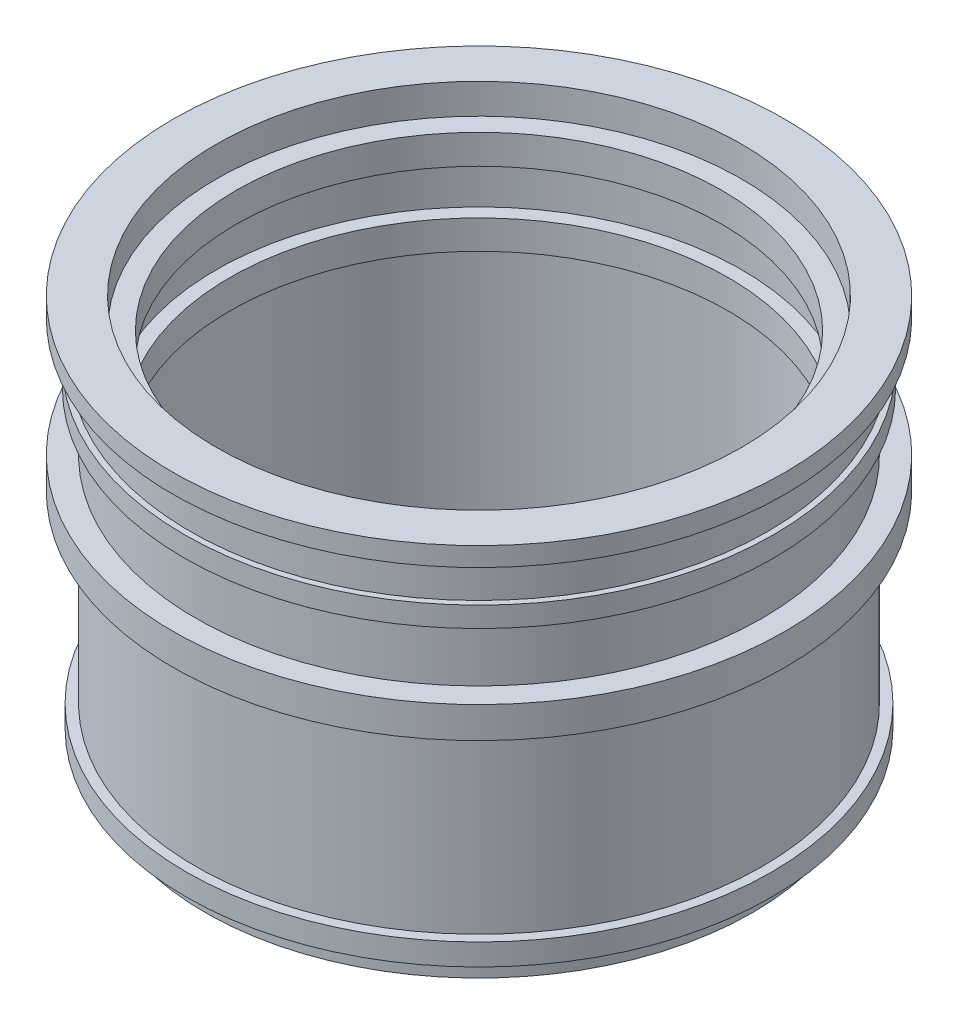
ISO-10303-21;
HEADER;
FILE_DESCRIPTION(('STEP AP214'),'2;1');
FILE_NAME('part.step','',(''),(''),'','','');
FILE_SCHEMA(('AUTOMOTIVE_DESIGN { 1 0 10303 214 1 1 1 1 }'));
ENDSEC;
DATA;
#1=APPLICATION_CONTEXT('core data for automotive mechanical design processes');
#2=APPLICATION_PROTOCOL_DEFINITION('international standard','automotive_design',2000,#1);
#3=PRODUCT_CONTEXT('',#1,'mechanical');
#4=PRODUCT('Part','Part','',(#3));
#5=PRODUCT_RELATED_PRODUCT_CATEGORY('part','',(#4));
#6=PRODUCT_DEFINITION_FORMATION('','',#4);
#7=PRODUCT_DEFINITION_CONTEXT('part definition',#1,'design');
#8=PRODUCT_DEFINITION('design','',#6,#7);
#9=PRODUCT_DEFINITION_SHAPE('','',#8);
#10=(LENGTH_UNIT() NAMED_UNIT(*) SI_UNIT(.MILLI.,.METRE.));
#11=(NAMED_UNIT(*) PLANE_ANGLE_UNIT() SI_UNIT($,.RADIAN.));
#12=(NAMED_UNIT(*) SI_UNIT($,.STERADIAN.) SOLID_ANGLE_UNIT());
#13=UNCERTAINTY_MEASURE_WITH_UNIT(LENGTH_MEASURE(1.E-05),#10,'distance_accuracy_value','');
#14=(GEOMETRIC_REPRESENTATION_CONTEXT(3) GLOBAL_UNCERTAINTY_ASSIGNED_CONTEXT((#13)) GLOBAL_UNIT_ASSIGNED_CONTEXT((#10,
#11,#12)) REPRESENTATION_CONTEXT('',''));
#15=CARTESIAN_POINT('',(0.,0.,0.));
#16=DIRECTION('',(0.,0.,1.));
#17=DIRECTION('',(1.,0.,0.));
#18=AXIS2_PLACEMENT_3D('',#15,#16,#17);
#19=CARTESIAN_POINT('',(-70.,0.,0.));
#20=DIRECTION('',(0.,1.,0.));
#21=DIRECTION('',(-1.,0.,0.));
#22=AXIS2_PLACEMENT_3D('',#19,#20,#21);
#23=PLANE('',#22);
#24=CARTESIAN_POINT('',(0.,2.40096571096915E-13,0.));
#25=DIRECTION('',(0.,-1.,0.));
#26=DIRECTION('',(1.,0.,0.));
#27=AXIS2_PLACEMENT_3D('',#24,#25,#26);
#28=CIRCLE('',#27,70.);
#29=CARTESIAN_POINT('',(70.,4.80214001018919E-13,0.));
#30=VERTEX_POINT('',#29);
#31=EDGE_CURVE('E119',#30,#30,#28,.T.);
#32=ORIENTED_EDGE('',*,*,#31,.F.);
#33=EDGE_LOOP('',(#32));
#34=FACE_BOUND('',#33,.T.);
#35=CARTESIAN_POINT('',(0.,2.59232739441284E-13,0.));
#36=DIRECTION('',(0.,-1.,0.));
#37=DIRECTION('',(1.,0.,0.));
#38=AXIS2_PLACEMENT_3D('',#35,#36,#37);
#39=CIRCLE('',#38,75.7848064008631);
#40=CARTESIAN_POINT('',(75.7848064008631,5.19193495728596E-13,0.));
#41=VERTEX_POINT('',#40);
#42=EDGE_CURVE('E10',#41,#41,#39,.T.);
#43=ORIENTED_EDGE('',*,*,#42,.T.);
#44=EDGE_LOOP('',(#43));
#45=FACE_BOUND('',#44,.T.);
#46=ADVANCED_FACE('F37',(#34,#45),#23,.F.);
#47=CARTESIAN_POINT('',(0.,-0.310935057524107,0.));
#48=DIRECTION('',(0.,-1.,0.));
#49=DIRECTION('',(1.,0.,0.));
#50=AXIS2_PLACEMENT_3D('',#47,#48,#49);
#51=CYLINDRICAL_SURFACE('',#50,75.7848064008631);
#52=ORIENTED_EDGE('',*,*,#42,.F.);
#53=EDGE_LOOP('',(#52));
#54=FACE_BOUND('',#53,.T.);
#55=CARTESIAN_POINT('',(0.,6.35632018163022,0.));
#56=DIRECTION('',(0.,-1.,0.));
#57=DIRECTION('',(1.,0.,0.));
#58=AXIS2_PLACEMENT_3D('',#55,#56,#57);
#59=CIRCLE('',#58,75.7848064008631);
#60=CARTESIAN_POINT('',(75.7848064008631,6.35632018163048,0.));
#61=VERTEX_POINT('',#60);
#62=EDGE_CURVE('E43',#61,#61,#59,.T.);
#63=ORIENTED_EDGE('',*,*,#62,.T.);
#64=EDGE_LOOP('',(#63));
#65=FACE_BOUND('',#64,.T.);
#66=ADVANCED_FACE('F126',(#54,#65),#51,.T.);
#67=CARTESIAN_POINT('',(-75.7848064008631,6.35632018162997,0.));
#68=DIRECTION('',(0.,1.,0.));
#69=DIRECTION('',(-1.,0.,0.));
#70=AXIS2_PLACEMENT_3D('',#67,#68,#69);
#71=PLANE('',#70);
#72=ORIENTED_EDGE('',*,*,#62,.F.);
#73=EDGE_LOOP('',(#72));
#74=FACE_BOUND('',#73,.T.);
#75=CARTESIAN_POINT('',(0.,6.35632018163024,0.));
#76=DIRECTION('',(0.,-1.,0.));
#77=DIRECTION('',(1.,0.,0.));
#78=AXIS2_PLACEMENT_3D('',#75,#76,#77);
#79=CIRCLE('',#78,81.0372711987121);
#80=CARTESIAN_POINT('',(81.0372711987121,6.35632018163052,0.));
#81=VERTEX_POINT('',#80);
#82=EDGE_CURVE('E47',#81,#81,#79,.T.);
#83=ORIENTED_EDGE('',*,*,#82,.T.);
#84=EDGE_LOOP('',(#83));
#85=FACE_BOUND('',#84,.T.);
#86=ADVANCED_FACE('F130',(#74,#85),#71,.F.);
#87=CARTESIAN_POINT('',(0.,-0.310935057524107,0.));
#88=DIRECTION('',(0.,-1.,0.));
#89=DIRECTION('',(1.,0.,0.));
#90=AXIS2_PLACEMENT_3D('',#87,#88,#89);
#91=CYLINDRICAL_SURFACE('',#90,81.0372711987121);
#92=ORIENTED_EDGE('',*,*,#82,.F.);
#93=EDGE_LOOP('',(#92));
#94=FACE_BOUND('',#93,.T.);
#95=CARTESIAN_POINT('',(0.,12.3591370934577,0.));
#96=DIRECTION('',(0.,-1.,0.));
#97=DIRECTION('',(1.,0.,0.));
#98=AXIS2_PLACEMENT_3D('',#95,#96,#97);
#99=CIRCLE('',#98,81.0372711987121);
#100=CARTESIAN_POINT('',(81.0372711987121,12.359137093458,0.));
#101=VERTEX_POINT('',#100);
#102=EDGE_CURVE('E51',#101,#101,#99,.T.);
#103=ORIENTED_EDGE('',*,*,#102,.T.);
#104=EDGE_LOOP('',(#103));
#105=FACE_BOUND('',#104,.T.);
#106=ADVANCED_FACE('F135',(#94,#105),#91,.T.);
#107=CARTESIAN_POINT('',(-81.0372711987121,12.3591370934575,0.));
#108=DIRECTION('',(0.,-1.,0.));
#109=DIRECTION('',(1.,0.,0.));
#110=AXIS2_PLACEMENT_3D('',#107,#108,#109);
#111=PLANE('',#110);
#112=ORIENTED_EDGE('',*,*,#102,.F.);
#113=EDGE_LOOP('',(#112));
#114=FACE_BOUND('',#113,.T.);
#115=CARTESIAN_POINT('',(0.,12.3591370934577,0.));
#116=DIRECTION('',(0.,-1.,0.));
#117=DIRECTION('',(1.,0.,0.));
#118=AXIS2_PLACEMENT_3D('',#115,#116,#117);
#119=CIRCLE('',#118,78.4110387997875);
#120=CARTESIAN_POINT('',(78.4110387997874,12.359137093458,0.));
#121=VERTEX_POINT('',#120);
#122=EDGE_CURVE('E56',#121,#121,#119,.T.);
#123=ORIENTED_EDGE('',*,*,#122,.T.);
#124=EDGE_LOOP('',(#123));
#125=FACE_BOUND('',#124,.T.);
#126=ADVANCED_FACE('F141',(#114,#125),#111,.F.);
#127=CARTESIAN_POINT('',(0.,-0.310935057524107,0.));
#128=DIRECTION('',(0.,-1.,0.));
#129=DIRECTION('',(1.,0.,0.));
#130=AXIS2_PLACEMENT_3D('',#127,#128,#129);
#131=CYLINDRICAL_SURFACE('',#130,78.4110387997874);
#132=ORIENTED_EDGE('',*,*,#122,.F.);
#133=EDGE_LOOP('',(#132));
#134=FACE_BOUND('',#133,.T.);
#135=CARTESIAN_POINT('',(-2.16939289288344E-13,63.2430151160489,0.));
#136=DIRECTION('',(0.,-1.,0.));
#137=DIRECTION('',(1.,0.,0.));
#138=AXIS2_PLACEMENT_3D('',#135,#136,#137);
#139=CIRCLE('',#138,78.4110387997873);
#140=CARTESIAN_POINT('',(78.4110387997871,63.2430151160491,0.));
#141=VERTEX_POINT('',#140);
#142=EDGE_CURVE('E59',#141,#141,#139,.T.);
#143=ORIENTED_EDGE('',*,*,#142,.T.);
#144=EDGE_LOOP('',(#143));
#145=FACE_BOUND('',#144,.T.);
#146=ADVANCED_FACE('F145',(#134,#145),#131,.T.);
#147=CARTESIAN_POINT('',(-78.4110387997875,63.2430151160486,0.));
#148=DIRECTION('',(0.,1.,0.));
#149=DIRECTION('',(-1.,0.,0.));
#150=AXIS2_PLACEMENT_3D('',#147,#148,#149);
#151=PLANE('',#150);
#152=ORIENTED_EDGE('',*,*,#142,.F.);
#153=EDGE_LOOP('',(#152));
#154=FACE_BOUND('',#153,.T.);
#155=CARTESIAN_POINT('',(-2.16939289288344E-13,63.2430151160489,0.));
#156=DIRECTION('',(0.,-1.,0.));
#157=DIRECTION('',(1.,0.,0.));
#158=AXIS2_PLACEMENT_3D('',#155,#156,#157);
#159=CIRCLE('',#158,84.7109951487502);
#160=CARTESIAN_POINT('',(84.71099514875,63.2430151160492,0.));
#161=VERTEX_POINT('',#160);
#162=EDGE_CURVE('E62',#161,#161,#159,.T.);
#163=ORIENTED_EDGE('',*,*,#162,.T.);
#164=EDGE_LOOP('',(#163));
#165=FACE_BOUND('',#164,.T.);
#166=ADVANCED_FACE('F149',(#154,#165),#151,.F.);
#167=CARTESIAN_POINT('',(0.,-0.310935057524107,0.));
#168=DIRECTION('',(0.,-1.,0.));
#169=DIRECTION('',(1.,0.,0.));
#170=AXIS2_PLACEMENT_3D('',#167,#168,#169);
#171=CYLINDRICAL_SURFACE('',#170,84.7109951487502);
#172=ORIENTED_EDGE('',*,*,#162,.F.);
#173=EDGE_LOOP('',(#172));
#174=FACE_BOUND('',#173,.T.);
#175=CARTESIAN_POINT('',(-2.46590554939643E-13,71.8870714690805,0.));
#176=DIRECTION('',(0.,-1.,0.));
#177=DIRECTION('',(1.,0.,0.));
#178=AXIS2_PLACEMENT_3D('',#175,#176,#177);
#179=CIRCLE('',#178,84.7109951487502);
#180=CARTESIAN_POINT('',(84.7109951487499,71.8870714690808,0.));
#181=VERTEX_POINT('',#180);
#182=EDGE_CURVE('E65',#181,#181,#179,.T.);
#183=ORIENTED_EDGE('',*,*,#182,.T.);
#184=EDGE_LOOP('',(#183));
#185=FACE_BOUND('',#184,.T.);
#186=ADVANCED_FACE('F153',(#174,#185),#171,.T.);
#187=CARTESIAN_POINT('',(-84.7109951487504,71.8870714690802,0.));
#188=DIRECTION('',(0.,-1.,0.));
#189=DIRECTION('',(1.,0.,0.));
#190=AXIS2_PLACEMENT_3D('',#187,#188,#189);
#191=PLANE('',#190);
#192=ORIENTED_EDGE('',*,*,#182,.F.);
#193=EDGE_LOOP('',(#192));
#194=FACE_BOUND('',#193,.T.);
#195=CARTESIAN_POINT('',(-2.46590554939643E-13,71.8870714690805,0.));
#196=DIRECTION('',(0.,-1.,0.));
#197=DIRECTION('',(1.,0.,0.));
#198=AXIS2_PLACEMENT_3D('',#195,#196,#197);
#199=CIRCLE('',#198,78.4110387997875);
#200=CARTESIAN_POINT('',(78.4110387997873,71.8870714690808,0.));
#201=VERTEX_POINT('',#200);
#202=EDGE_CURVE('E68',#201,#201,#199,.T.);
#203=ORIENTED_EDGE('',*,*,#202,.T.);
#204=EDGE_LOOP('',(#203));
#205=FACE_BOUND('',#204,.T.);
#206=ADVANCED_FACE('F157',(#194,#205),#191,.F.);
#207=CARTESIAN_POINT('',(0.,-0.310935057524107,0.));
#208=DIRECTION('',(0.,-1.,0.));
#209=DIRECTION('',(1.,0.,0.));
#210=AXIS2_PLACEMENT_3D('',#207,#208,#209);
#211=CYLINDRICAL_SURFACE('',#210,78.4110387997875);
#212=ORIENTED_EDGE('',*,*,#202,.F.);
#213=EDGE_LOOP('',(#212));
#214=FACE_BOUND('',#213,.T.);
#215=CARTESIAN_POINT('',(-3.01445396394546E-13,87.878575722189,0.));
#216=DIRECTION('',(0.,-1.,0.));
#217=DIRECTION('',(1.,0.,0.));
#218=AXIS2_PLACEMENT_3D('',#215,#216,#217);
#219=CIRCLE('',#218,78.4110387997875);
#220=CARTESIAN_POINT('',(78.4110387997871,87.8785757221893,0.));
#221=VERTEX_POINT('',#220);
#222=EDGE_CURVE('E71',#221,#221,#219,.T.);
#223=ORIENTED_EDGE('',*,*,#222,.T.);
#224=EDGE_LOOP('',(#223));
#225=FACE_BOUND('',#224,.T.);
#226=ADVANCED_FACE('F161',(#214,#225),#211,.T.);
#227=CARTESIAN_POINT('',(-78.4110387997878,87.8785757221887,0.));
#228=DIRECTION('',(0.,1.,0.));
#229=DIRECTION('',(-1.,0.,0.));
#230=AXIS2_PLACEMENT_3D('',#227,#228,#229);
#231=PLANE('',#230);
#232=ORIENTED_EDGE('',*,*,#222,.F.);
#233=EDGE_LOOP('',(#232));
#234=FACE_BOUND('',#233,.T.);
#235=CARTESIAN_POINT('',(-3.01445396394546E-13,87.878575722189,0.));
#236=DIRECTION('',(0.,-1.,0.));
#237=DIRECTION('',(1.,0.,0.));
#238=AXIS2_PLACEMENT_3D('',#235,#236,#237);
#239=CIRCLE('',#238,81.5610169742689);
#240=CARTESIAN_POINT('',(81.5610169742686,87.8785757221893,0.));
#241=VERTEX_POINT('',#240);
#242=EDGE_CURVE('E74',#241,#241,#239,.T.);
#243=ORIENTED_EDGE('',*,*,#242,.T.);
#244=EDGE_LOOP('',(#243));
#245=FACE_BOUND('',#244,.T.);
#246=ADVANCED_FACE('F165',(#234,#245),#231,.F.);
#247=CARTESIAN_POINT('',(0.,-0.310935057524107,0.));
#248=DIRECTION('',(0.,-1.,0.));
#249=DIRECTION('',(1.,0.,0.));
#250=AXIS2_PLACEMENT_3D('',#247,#248,#249);
#251=CYLINDRICAL_SURFACE('',#250,81.5610169742689);
#252=ORIENTED_EDGE('',*,*,#242,.F.);
#253=EDGE_LOOP('',(#252));
#254=FACE_BOUND('',#253,.T.);
#255=CARTESIAN_POINT('',(-3.2071871906789E-13,93.4972123516595,0.));
#256=DIRECTION('',(0.,-1.,0.));
#257=DIRECTION('',(1.,0.,0.));
#258=AXIS2_PLACEMENT_3D('',#255,#256,#257);
#259=CIRCLE('',#258,81.5610169742689);
#260=CARTESIAN_POINT('',(81.5610169742686,93.4972123516598,0.));
#261=VERTEX_POINT('',#260);
#262=EDGE_CURVE('E77',#261,#261,#259,.T.);
#263=ORIENTED_EDGE('',*,*,#262,.T.);
#264=EDGE_LOOP('',(#263));
#265=FACE_BOUND('',#264,.T.);
#266=ADVANCED_FACE('F169',(#254,#265),#251,.T.);
#267=CARTESIAN_POINT('',(-81.5610169742692,93.4972123516593,0.));
#268=DIRECTION('',(0.,-1.,0.));
#269=DIRECTION('',(1.,0.,0.));
#270=AXIS2_PLACEMENT_3D('',#267,#268,#269);
#271=PLANE('',#270);
#272=ORIENTED_EDGE('',*,*,#262,.F.);
#273=EDGE_LOOP('',(#272));
#274=FACE_BOUND('',#273,.T.);
#275=CARTESIAN_POINT('',(-3.2071871906789E-13,93.4972123516595,0.));
#276=DIRECTION('',(0.,-1.,0.));
#277=DIRECTION('',(1.,0.,0.));
#278=AXIS2_PLACEMENT_3D('',#275,#276,#277);
#279=CIRCLE('',#278,79.9860278870277);
#280=CARTESIAN_POINT('',(79.9860278870273,93.4972123516598,0.));
#281=VERTEX_POINT('',#280);
#282=EDGE_CURVE('E80',#281,#281,#279,.T.);
#283=ORIENTED_EDGE('',*,*,#282,.T.);
#284=EDGE_LOOP('',(#283));
#285=FACE_BOUND('',#284,.T.);
#286=ADVANCED_FACE('F173',(#274,#285),#271,.F.);
#287=CARTESIAN_POINT('',(0.,-0.310935057524107,0.));
#288=DIRECTION('',(0.,-1.,0.));
#289=DIRECTION('',(1.,0.,0.));
#290=AXIS2_PLACEMENT_3D('',#287,#288,#289);
#291=CYLINDRICAL_SURFACE('',#290,79.9860278870276);
#292=ORIENTED_EDGE('',*,*,#282,.F.);
#293=EDGE_LOOP('',(#292));
#294=FACE_BOUND('',#293,.T.);
#295=CARTESIAN_POINT('',(-3.59265364414579E-13,104.734485610601,0.));
#296=DIRECTION('',(0.,-1.,0.));
#297=DIRECTION('',(1.,0.,0.));
#298=AXIS2_PLACEMENT_3D('',#295,#296,#297);
#299=CIRCLE('',#298,79.9860278870276);
#300=CARTESIAN_POINT('',(79.9860278870273,104.734485610601,0.));
#301=VERTEX_POINT('',#300);
#302=EDGE_CURVE('E83',#301,#301,#299,.T.);
#303=ORIENTED_EDGE('',*,*,#302,.T.);
#304=EDGE_LOOP('',(#303));
#305=FACE_BOUND('',#304,.T.);
#306=ADVANCED_FACE('F177',(#294,#305),#291,.T.);
#307=CARTESIAN_POINT('',(-79.986027887028,104.7344856106,0.));
#308=DIRECTION('',(0.,1.,0.));
#309=DIRECTION('',(-1.,0.,0.));
#310=AXIS2_PLACEMENT_3D('',#307,#308,#309);
#311=PLANE('',#310);
#312=ORIENTED_EDGE('',*,*,#302,.F.);
#313=EDGE_LOOP('',(#312));
#314=FACE_BOUND('',#313,.T.);
#315=CARTESIAN_POINT('',(-3.59265364414579E-13,104.734485610601,0.));
#316=DIRECTION('',(0.,-1.,0.));
#317=DIRECTION('',(1.,0.,0.));
#318=AXIS2_PLACEMENT_3D('',#315,#316,#317);
#319=CIRCLE('',#318,84.7109951487498);
#320=CARTESIAN_POINT('',(84.7109951487494,104.734485610601,0.));
#321=VERTEX_POINT('',#320);
#322=EDGE_CURVE('E86',#321,#321,#319,.T.);
#323=ORIENTED_EDGE('',*,*,#322,.T.);
#324=EDGE_LOOP('',(#323));
#325=FACE_BOUND('',#324,.T.);
#326=ADVANCED_FACE('F181',(#314,#325),#311,.F.);
#327=CARTESIAN_POINT('',(0.,-0.310935057524107,0.));
#328=DIRECTION('',(0.,-1.,0.));
#329=DIRECTION('',(1.,0.,0.));
#330=AXIS2_PLACEMENT_3D('',#327,#328,#329);
#331=CYLINDRICAL_SURFACE('',#330,84.7109951487497);
#332=ORIENTED_EDGE('',*,*,#322,.F.);
#333=EDGE_LOOP('',(#332));
#334=FACE_BOUND('',#333,.T.);
#335=CARTESIAN_POINT('',(-3.77327389877435E-13,110.,0.));
#336=DIRECTION('',(0.,-1.,0.));
#337=DIRECTION('',(1.,0.,0.));
#338=AXIS2_PLACEMENT_3D('',#335,#336,#337);
#339=CIRCLE('',#338,84.7109951487497);
#340=CARTESIAN_POINT('',(84.7109951487494,110.000000000001,0.));
#341=VERTEX_POINT('',#340);
#342=EDGE_CURVE('E89',#341,#341,#339,.T.);
#343=ORIENTED_EDGE('',*,*,#342,.T.);
#344=EDGE_LOOP('',(#343));
#345=FACE_BOUND('',#344,.T.);
#346=ADVANCED_FACE('F185',(#334,#345),#331,.T.);
#347=CARTESIAN_POINT('',(-84.7109951487501,110.,0.));
#348=DIRECTION('',(0.,-1.,0.));
#349=DIRECTION('',(1.,0.,0.));
#350=AXIS2_PLACEMENT_3D('',#347,#348,#349);
#351=PLANE('',#350);
#352=ORIENTED_EDGE('',*,*,#342,.F.);
#353=EDGE_LOOP('',(#352));
#354=FACE_BOUND('',#353,.T.);
#355=CARTESIAN_POINT('',(-3.77327389877435E-13,110.,0.));
#356=DIRECTION('',(0.,-1.,0.));
#357=DIRECTION('',(1.,0.,0.));
#358=AXIS2_PLACEMENT_3D('',#355,#356,#357);
#359=CIRCLE('',#358,72.7283584665372);
#360=CARTESIAN_POINT('',(72.7283584665369,110.,0.));
#361=VERTEX_POINT('',#360);
#362=EDGE_CURVE('E92',#361,#361,#359,.T.);
#363=ORIENTED_EDGE('',*,*,#362,.T.);
#364=EDGE_LOOP('',(#363));
#365=FACE_BOUND('',#364,.T.);
#366=ADVANCED_FACE('F189',(#354,#365),#351,.F.);
#367=CARTESIAN_POINT('',(0.,-0.310935057524107,0.));
#368=DIRECTION('',(0.,-1.,0.));
#369=DIRECTION('',(1.,0.,0.));
#370=AXIS2_PLACEMENT_3D('',#367,#368,#369);
#371=CYLINDRICAL_SURFACE('',#370,72.7283584665373);
#372=ORIENTED_EDGE('',*,*,#362,.F.);
#373=EDGE_LOOP('',(#372));
#374=FACE_BOUND('',#373,.T.);
#375=CARTESIAN_POINT('',(-3.48650328275775E-13,101.639947534137,0.));
#376=DIRECTION('',(0.,-1.,0.));
#377=DIRECTION('',(1.,0.,0.));
#378=AXIS2_PLACEMENT_3D('',#375,#376,#377);
#379=CIRCLE('',#378,72.7283584665373);
#380=CARTESIAN_POINT('',(72.7283584665369,101.639947534137,0.));
#381=VERTEX_POINT('',#380);
#382=EDGE_CURVE('E95',#381,#381,#379,.T.);
#383=ORIENTED_EDGE('',*,*,#382,.T.);
#384=EDGE_LOOP('',(#383));
#385=FACE_BOUND('',#384,.T.);
#386=ADVANCED_FACE('F193',(#374,#385),#371,.F.);
#387=CARTESIAN_POINT('',(-72.7283584665376,101.639947534137,0.));
#388=DIRECTION('',(0.,-1.,0.));
#389=DIRECTION('',(1.,0.,0.));
#390=AXIS2_PLACEMENT_3D('',#387,#388,#389);
#391=PLANE('',#390);
#392=ORIENTED_EDGE('',*,*,#382,.F.);
#393=EDGE_LOOP('',(#392));
#394=FACE_BOUND('',#393,.T.);
#395=CARTESIAN_POINT('',(-3.48650328275775E-13,101.639947534137,0.));
#396=DIRECTION('',(0.,-1.,0.));
#397=DIRECTION('',(1.,0.,0.));
#398=AXIS2_PLACEMENT_3D('',#395,#396,#397);
#399=CIRCLE('',#398,67.2716415334614);
#400=CARTESIAN_POINT('',(67.2716415334611,101.639947534137,0.));
#401=VERTEX_POINT('',#400);
#402=EDGE_CURVE('E98',#401,#401,#399,.T.);
#403=ORIENTED_EDGE('',*,*,#402,.T.);
#404=EDGE_LOOP('',(#403));
#405=FACE_BOUND('',#404,.T.);
#406=ADVANCED_FACE('F197',(#394,#405),#391,.F.);
#407=CARTESIAN_POINT('',(0.,-0.310935057524107,0.));
#408=DIRECTION('',(0.,-1.,0.));
#409=DIRECTION('',(1.,0.,0.));
#410=AXIS2_PLACEMENT_3D('',#407,#408,#409);
#411=CYLINDRICAL_SURFACE('',#410,67.2716415334615);
#412=ORIENTED_EDGE('',*,*,#402,.F.);
#413=EDGE_LOOP('',(#412));
#414=FACE_BOUND('',#413,.T.);
#415=CARTESIAN_POINT('',(-3.20718719067891E-13,93.4972123516597,0.));
#416=DIRECTION('',(0.,-1.,0.));
#417=DIRECTION('',(1.,0.,0.));
#418=AXIS2_PLACEMENT_3D('',#415,#416,#417);
#419=CIRCLE('',#418,67.2716415334615);
#420=CARTESIAN_POINT('',(67.2716415334612,93.49721235166,0.));
#421=VERTEX_POINT('',#420);
#422=EDGE_CURVE('E101',#421,#421,#419,.T.);
#423=ORIENTED_EDGE('',*,*,#422,.T.);
#424=EDGE_LOOP('',(#423));
#425=FACE_BOUND('',#424,.T.);
#426=ADVANCED_FACE('F201',(#414,#425),#411,.F.);
#427=CARTESIAN_POINT('',(-67.2716415334618,93.4972123516595,0.));
#428=DIRECTION('',(0.,1.,0.));
#429=DIRECTION('',(-1.,0.,0.));
#430=AXIS2_PLACEMENT_3D('',#427,#428,#429);
#431=PLANE('',#430);
#432=ORIENTED_EDGE('',*,*,#422,.F.);
#433=EDGE_LOOP('',(#432));
#434=FACE_BOUND('',#433,.T.);
#435=CARTESIAN_POINT('',(-3.20718719067891E-13,93.4972123516597,0.));
#436=DIRECTION('',(0.,-1.,0.));
#437=DIRECTION('',(1.,0.,0.));
#438=AXIS2_PLACEMENT_3D('',#435,#436,#437);
#439=CIRCLE('',#438,72.7283584665373);
#440=CARTESIAN_POINT('',(72.728358466537,93.49721235166,0.));
#441=VERTEX_POINT('',#440);
#442=EDGE_CURVE('E104',#441,#441,#439,.T.);
#443=ORIENTED_EDGE('',*,*,#442,.T.);
#444=EDGE_LOOP('',(#443));
#445=FACE_BOUND('',#444,.T.);
#446=ADVANCED_FACE('F205',(#434,#445),#431,.F.);
#447=CARTESIAN_POINT('',(0.,-0.310935057524107,0.));
#448=DIRECTION('',(0.,-1.,0.));
#449=DIRECTION('',(1.,0.,0.));
#450=AXIS2_PLACEMENT_3D('',#447,#448,#449);
#451=CYLINDRICAL_SURFACE('',#450,72.7283584665373);
#452=ORIENTED_EDGE('',*,*,#442,.F.);
#453=EDGE_LOOP('',(#452));
#454=FACE_BOUND('',#453,.T.);
#455=CARTESIAN_POINT('',(-2.74017975667094E-13,79.8828235956347,0.));
#456=DIRECTION('',(0.,-1.,0.));
#457=DIRECTION('',(1.,0.,0.));
#458=AXIS2_PLACEMENT_3D('',#455,#456,#457);
#459=CIRCLE('',#458,72.7283584665373);
#460=CARTESIAN_POINT('',(72.7283584665371,79.882823595635,0.));
#461=VERTEX_POINT('',#460);
#462=EDGE_CURVE('E107',#461,#461,#459,.T.);
#463=ORIENTED_EDGE('',*,*,#462,.T.);
#464=EDGE_LOOP('',(#463));
#465=FACE_BOUND('',#464,.T.);
#466=ADVANCED_FACE('F209',(#454,#465),#451,.F.);
#467=CARTESIAN_POINT('',(-72.7283584665376,79.8828235956345,0.));
#468=DIRECTION('',(0.,-1.,0.));
#469=DIRECTION('',(1.,0.,0.));
#470=AXIS2_PLACEMENT_3D('',#467,#468,#469);
#471=PLANE('',#470);
#472=ORIENTED_EDGE('',*,*,#462,.F.);
#473=EDGE_LOOP('',(#472));
#474=FACE_BOUND('',#473,.T.);
#475=CARTESIAN_POINT('',(-2.74017975667094E-13,79.8828235956347,0.));
#476=DIRECTION('',(0.,-1.,0.));
#477=DIRECTION('',(1.,0.,0.));
#478=AXIS2_PLACEMENT_3D('',#475,#476,#477);
#479=CIRCLE('',#478,68.9999999999997);
#480=CARTESIAN_POINT('',(68.9999999999994,79.8828235956349,0.));
#481=VERTEX_POINT('',#480);
#482=EDGE_CURVE('E110',#481,#481,#479,.T.);
#483=ORIENTED_EDGE('',*,*,#482,.T.);
#484=EDGE_LOOP('',(#483));
#485=FACE_BOUND('',#484,.T.);
#486=ADVANCED_FACE('F213',(#474,#485),#471,.F.);
#487=CARTESIAN_POINT('',(0.,-0.310935057524107,0.));
#488=DIRECTION('',(0.,-1.,0.));
#489=DIRECTION('',(1.,0.,0.));
#490=AXIS2_PLACEMENT_3D('',#487,#488,#489);
#491=CYLINDRICAL_SURFACE('',#490,68.9999999999997);
#492=ORIENTED_EDGE('',*,*,#482,.F.);
#493=EDGE_LOOP('',(#492));
#494=FACE_BOUND('',#493,.T.);
#495=CARTESIAN_POINT('',(-2.46590554939643E-13,71.8870714690805,0.));
#496=DIRECTION('',(0.,-1.,0.));
#497=DIRECTION('',(1.,0.,0.));
#498=AXIS2_PLACEMENT_3D('',#495,#496,#497);
#499=CIRCLE('',#498,68.9999999999998);
#500=CARTESIAN_POINT('',(68.9999999999995,71.8870714690807,0.));
#501=VERTEX_POINT('',#500);
#502=EDGE_CURVE('E113',#501,#501,#499,.T.);
#503=ORIENTED_EDGE('',*,*,#502,.T.);
#504=EDGE_LOOP('',(#503));
#505=FACE_BOUND('',#504,.T.);
#506=ADVANCED_FACE('F217',(#494,#505),#491,.F.);
#507=CARTESIAN_POINT('',(-69.,71.8870714690802,0.));
#508=DIRECTION('',(0.,1.,0.));
#509=DIRECTION('',(-1.,0.,0.));
#510=AXIS2_PLACEMENT_3D('',#507,#508,#509);
#511=PLANE('',#510);
#512=ORIENTED_EDGE('',*,*,#502,.F.);
#513=EDGE_LOOP('',(#512));
#514=FACE_BOUND('',#513,.T.);
#515=CARTESIAN_POINT('',(-2.46590554939643E-13,71.8870714690805,0.));
#516=DIRECTION('',(0.,-1.,0.));
#517=DIRECTION('',(1.,0.,0.));
#518=AXIS2_PLACEMENT_3D('',#515,#516,#517);
#519=CIRCLE('',#518,70.);
#520=CARTESIAN_POINT('',(69.9999999999997,71.8870714690807,0.));
#521=VERTEX_POINT('',#520);
#522=EDGE_CURVE('E116',#521,#521,#519,.T.);
#523=ORIENTED_EDGE('',*,*,#522,.T.);
#524=EDGE_LOOP('',(#523));
#525=FACE_BOUND('',#524,.T.);
#526=ADVANCED_FACE('F221',(#514,#525),#511,.F.);
#527=CARTESIAN_POINT('',(0.,-0.310935057524107,0.));
#528=DIRECTION('',(0.,-1.,0.));
#529=DIRECTION('',(1.,0.,0.));
#530=AXIS2_PLACEMENT_3D('',#527,#528,#529);
#531=CYLINDRICAL_SURFACE('',#530,70.);
#532=ORIENTED_EDGE('',*,*,#522,.F.);
#533=EDGE_LOOP('',(#532));
#534=FACE_BOUND('',#533,.T.);
#535=ORIENTED_EDGE('',*,*,#31,.T.);
#536=EDGE_LOOP('',(#535));
#537=FACE_BOUND('',#536,.T.);
#538=ADVANCED_FACE('F123',(#534,#537),#531,.F.);
#539=CLOSED_SHELL('',(#46,#66,#86,#106,#126,#146,#166,#186,#206,#226,#246,#266,#286,#306,#326,
#346,#366,#386,#406,#426,#446,#466,#486,#506,#526,#538));
#540=MANIFOLD_SOLID_BREP('B2',#539);
#541=ADVANCED_BREP_SHAPE_REPRESENTATION('',(#18,#540),#14);
#542=SHAPE_DEFINITION_REPRESENTATION(#9,#541);
ENDSEC;
END-ISO-10303-21;
